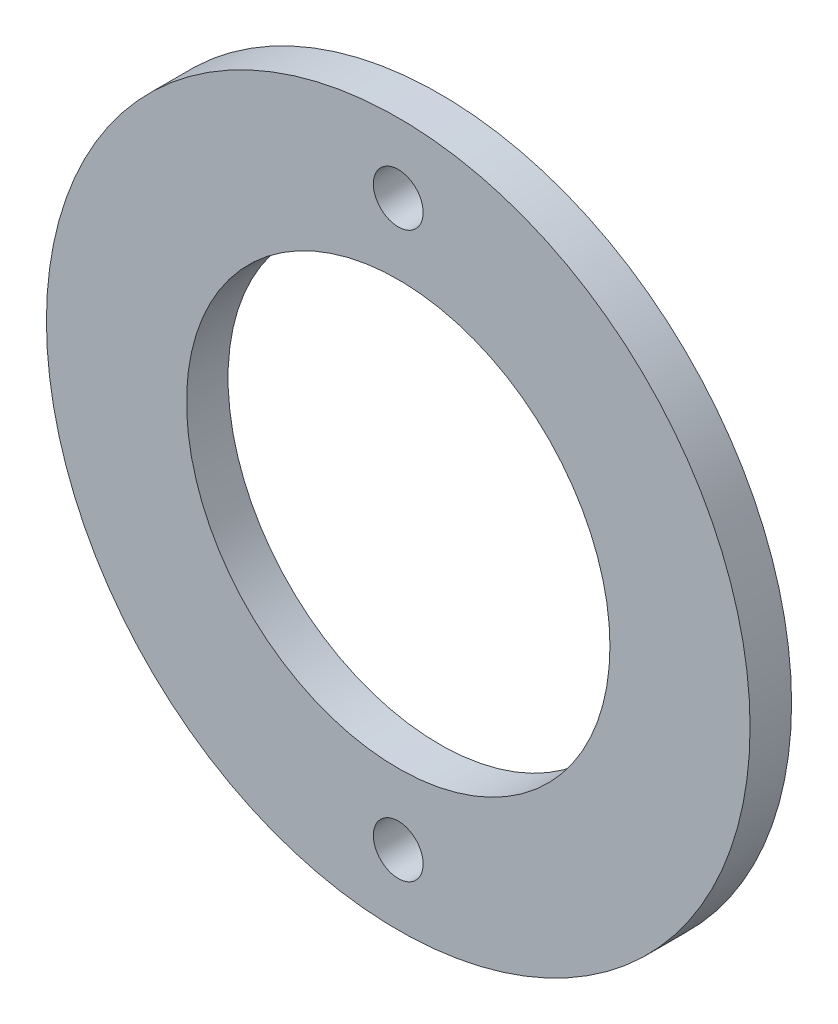
ISO-10303-21;
HEADER;
FILE_DESCRIPTION(('STEP AP214'),'2;1');
FILE_NAME('part.step','',(''),(''),'','','');
FILE_SCHEMA(('AUTOMOTIVE_DESIGN { 1 0 10303 214 1 1 1 1 }'));
ENDSEC;
DATA;
#1=APPLICATION_CONTEXT('core data for automotive mechanical design processes');
#2=APPLICATION_PROTOCOL_DEFINITION('international standard','automotive_design',2000,#1);
#3=PRODUCT_CONTEXT('',#1,'mechanical');
#4=PRODUCT('Part','Part','',(#3));
#5=PRODUCT_RELATED_PRODUCT_CATEGORY('part','',(#4));
#6=PRODUCT_DEFINITION_FORMATION('','',#4);
#7=PRODUCT_DEFINITION_CONTEXT('part definition',#1,'design');
#8=PRODUCT_DEFINITION('design','',#6,#7);
#9=PRODUCT_DEFINITION_SHAPE('','',#8);
#10=(LENGTH_UNIT() NAMED_UNIT(*) SI_UNIT(.MILLI.,.METRE.));
#11=(NAMED_UNIT(*) PLANE_ANGLE_UNIT() SI_UNIT($,.RADIAN.));
#12=(NAMED_UNIT(*) SI_UNIT($,.STERADIAN.) SOLID_ANGLE_UNIT());
#13=UNCERTAINTY_MEASURE_WITH_UNIT(LENGTH_MEASURE(1.E-05),#10,'distance_accuracy_value','');
#14=(GEOMETRIC_REPRESENTATION_CONTEXT(3) GLOBAL_UNCERTAINTY_ASSIGNED_CONTEXT((#13)) GLOBAL_UNIT_ASSIGNED_CONTEXT((#10,
#11,#12)) REPRESENTATION_CONTEXT('',''));
#15=CARTESIAN_POINT('',(0.,0.,0.));
#16=DIRECTION('',(0.,0.,1.));
#17=DIRECTION('',(1.,0.,0.));
#18=AXIS2_PLACEMENT_3D('',#15,#16,#17);
#19=CARTESIAN_POINT('',(0.,0.,3.175));
#20=DIRECTION('',(0.,0.,1.));
#21=DIRECTION('',(1.,0.,0.));
#22=AXIS2_PLACEMENT_3D('',#19,#20,#21);
#23=PLANE('',#22);
#24=CARTESIAN_POINT('',(0.,21.59,3.175));
#25=DIRECTION('',(0.,0.,1.));
#26=DIRECTION('',(1.,0.,0.));
#27=AXIS2_PLACEMENT_3D('',#24,#25,#26);
#28=CIRCLE('',#27,1.905);
#29=CARTESIAN_POINT('',(1.905,21.59,3.175));
#30=VERTEX_POINT('',#29);
#31=EDGE_CURVE('E47',#30,#30,#28,.T.);
#32=ORIENTED_EDGE('',*,*,#31,.F.);
#33=EDGE_LOOP('',(#32));
#34=FACE_BOUND('',#33,.T.);
#35=CARTESIAN_POINT('',(0.,0.,3.175));
#36=DIRECTION('',(0.,0.,1.));
#37=DIRECTION('',(1.,0.,0.));
#38=AXIS2_PLACEMENT_3D('',#35,#36,#37);
#39=CIRCLE('',#38,26.924);
#40=CARTESIAN_POINT('',(26.924,0.,3.175));
#41=VERTEX_POINT('',#40);
#42=EDGE_CURVE('E10',#41,#41,#39,.T.);
#43=ORIENTED_EDGE('',*,*,#42,.T.);
#44=EDGE_LOOP('',(#43));
#45=FACE_BOUND('',#44,.T.);
#46=CARTESIAN_POINT('',(0.,0.,3.175));
#47=DIRECTION('',(0.,0.,1.));
#48=DIRECTION('',(1.,0.,0.));
#49=AXIS2_PLACEMENT_3D('',#46,#47,#48);
#50=CIRCLE('',#49,16.2);
#51=CARTESIAN_POINT('',(16.2,0.,3.175));
#52=VERTEX_POINT('',#51);
#53=EDGE_CURVE('E42',#52,#52,#50,.T.);
#54=ORIENTED_EDGE('',*,*,#53,.F.);
#55=EDGE_LOOP('',(#54));
#56=FACE_BOUND('',#55,.T.);
#57=CARTESIAN_POINT('',(0.,-21.59,3.175));
#58=DIRECTION('',(0.,0.,1.));
#59=DIRECTION('',(1.,0.,0.));
#60=AXIS2_PLACEMENT_3D('',#57,#58,#59);
#61=CIRCLE('',#60,1.905);
#62=CARTESIAN_POINT('',(1.905,-21.59,3.175));
#63=VERTEX_POINT('',#62);
#64=EDGE_CURVE('E53',#63,#63,#61,.T.);
#65=ORIENTED_EDGE('',*,*,#64,.F.);
#66=EDGE_LOOP('',(#65));
#67=FACE_BOUND('',#66,.T.);
#68=ADVANCED_FACE('F31',(#34,#45,#56,#67),#23,.T.);
#69=CARTESIAN_POINT('',(0.,0.,0.));
#70=DIRECTION('',(0.,0.,1.));
#71=DIRECTION('',(1.,0.,0.));
#72=AXIS2_PLACEMENT_3D('',#69,#70,#71);
#73=PLANE('',#72);
#74=CARTESIAN_POINT('',(0.,0.,0.));
#75=DIRECTION('',(0.,0.,1.));
#76=DIRECTION('',(1.,0.,0.));
#77=AXIS2_PLACEMENT_3D('',#74,#75,#76);
#78=CIRCLE('',#77,26.924);
#79=CARTESIAN_POINT('',(26.924,0.,0.));
#80=VERTEX_POINT('',#79);
#81=EDGE_CURVE('E35',#80,#80,#78,.T.);
#82=ORIENTED_EDGE('',*,*,#81,.F.);
#83=EDGE_LOOP('',(#82));
#84=FACE_BOUND('',#83,.T.);
#85=CARTESIAN_POINT('',(0.,0.,0.));
#86=DIRECTION('',(0.,0.,1.));
#87=DIRECTION('',(1.,0.,0.));
#88=AXIS2_PLACEMENT_3D('',#85,#86,#87);
#89=CIRCLE('',#88,16.2);
#90=CARTESIAN_POINT('',(16.2,0.,0.));
#91=VERTEX_POINT('',#90);
#92=EDGE_CURVE('E44',#91,#91,#89,.T.);
#93=ORIENTED_EDGE('',*,*,#92,.T.);
#94=EDGE_LOOP('',(#93));
#95=FACE_BOUND('',#94,.T.);
#96=CARTESIAN_POINT('',(0.,21.59,0.));
#97=DIRECTION('',(0.,0.,1.));
#98=DIRECTION('',(1.,0.,0.));
#99=AXIS2_PLACEMENT_3D('',#96,#97,#98);
#100=CIRCLE('',#99,1.905);
#101=CARTESIAN_POINT('',(1.905,21.59,0.));
#102=VERTEX_POINT('',#101);
#103=EDGE_CURVE('E50',#102,#102,#100,.T.);
#104=ORIENTED_EDGE('',*,*,#103,.T.);
#105=EDGE_LOOP('',(#104));
#106=FACE_BOUND('',#105,.T.);
#107=CARTESIAN_POINT('',(0.,-21.59,0.));
#108=DIRECTION('',(0.,0.,1.));
#109=DIRECTION('',(1.,0.,0.));
#110=AXIS2_PLACEMENT_3D('',#107,#108,#109);
#111=CIRCLE('',#110,1.905);
#112=CARTESIAN_POINT('',(1.905,-21.59,0.));
#113=VERTEX_POINT('',#112);
#114=EDGE_CURVE('E56',#113,#113,#111,.T.);
#115=ORIENTED_EDGE('',*,*,#114,.T.);
#116=EDGE_LOOP('',(#115));
#117=FACE_BOUND('',#116,.T.);
#118=ADVANCED_FACE('F66',(#84,#95,#106,#117),#73,.F.);
#119=CARTESIAN_POINT('',(0.,0.,3.175));
#120=DIRECTION('',(0.,0.,-1.));
#121=DIRECTION('',(-1.,0.,0.));
#122=AXIS2_PLACEMENT_3D('',#119,#120,#121);
#123=CYLINDRICAL_SURFACE('',#122,26.924);
#124=ORIENTED_EDGE('',*,*,#42,.F.);
#125=EDGE_LOOP('',(#124));
#126=FACE_BOUND('',#125,.T.);
#127=ORIENTED_EDGE('',*,*,#81,.T.);
#128=EDGE_LOOP('',(#127));
#129=FACE_BOUND('',#128,.T.);
#130=ADVANCED_FACE('F33',(#126,#129),#123,.T.);
#131=CARTESIAN_POINT('',(0.,0.,3.175));
#132=DIRECTION('',(0.,0.,-1.));
#133=DIRECTION('',(-1.,0.,0.));
#134=AXIS2_PLACEMENT_3D('',#131,#132,#133);
#135=CYLINDRICAL_SURFACE('',#134,16.2);
#136=ORIENTED_EDGE('',*,*,#53,.T.);
#137=EDGE_LOOP('',(#136));
#138=FACE_BOUND('',#137,.T.);
#139=ORIENTED_EDGE('',*,*,#92,.F.);
#140=EDGE_LOOP('',(#139));
#141=FACE_BOUND('',#140,.T.);
#142=ADVANCED_FACE('F75',(#138,#141),#135,.F.);
#143=CARTESIAN_POINT('',(0.,21.59,3.175));
#144=DIRECTION('',(0.,0.,-1.));
#145=DIRECTION('',(-1.,0.,0.));
#146=AXIS2_PLACEMENT_3D('',#143,#144,#145);
#147=CYLINDRICAL_SURFACE('',#146,1.905);
#148=ORIENTED_EDGE('',*,*,#31,.T.);
#149=EDGE_LOOP('',(#148));
#150=FACE_BOUND('',#149,.T.);
#151=ORIENTED_EDGE('',*,*,#103,.F.);
#152=EDGE_LOOP('',(#151));
#153=FACE_BOUND('',#152,.T.);
#154=ADVANCED_FACE('F78',(#150,#153),#147,.F.);
#155=CARTESIAN_POINT('',(0.,-21.59,3.175));
#156=DIRECTION('',(0.,0.,-1.));
#157=DIRECTION('',(-1.,0.,0.));
#158=AXIS2_PLACEMENT_3D('',#155,#156,#157);
#159=CYLINDRICAL_SURFACE('',#158,1.905);
#160=ORIENTED_EDGE('',*,*,#64,.T.);
#161=EDGE_LOOP('',(#160));
#162=FACE_BOUND('',#161,.T.);
#163=ORIENTED_EDGE('',*,*,#114,.F.);
#164=EDGE_LOOP('',(#163));
#165=FACE_BOUND('',#164,.T.);
#166=ADVANCED_FACE('F62',(#162,#165),#159,.F.);
#167=CLOSED_SHELL('',(#68,#118,#130,#142,#154,#166));
#168=MANIFOLD_SOLID_BREP('B2',#167);
#169=ADVANCED_BREP_SHAPE_REPRESENTATION('',(#18,#168),#14);
#170=SHAPE_DEFINITION_REPRESENTATION(#9,#169);
ENDSEC;
END-ISO-10303-21;
